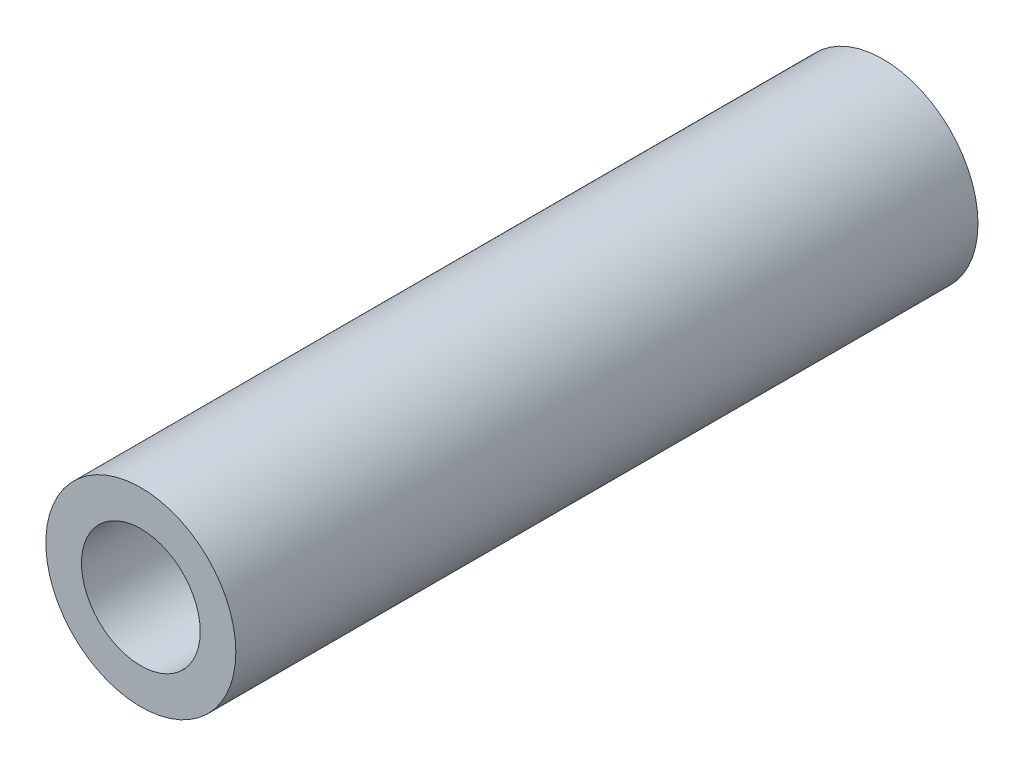
ISO-10303-21;
HEADER;
FILE_DESCRIPTION(('STEP AP214'),'2;1');
FILE_NAME('part.step','',(''),(''),'','','');
FILE_SCHEMA(('AUTOMOTIVE_DESIGN { 1 0 10303 214 1 1 1 1 }'));
ENDSEC;
DATA;
#1=APPLICATION_CONTEXT('core data for automotive mechanical design processes');
#2=APPLICATION_PROTOCOL_DEFINITION('international standard','automotive_design',2000,#1);
#3=PRODUCT_CONTEXT('',#1,'mechanical');
#4=PRODUCT('Part','Part','',(#3));
#5=PRODUCT_RELATED_PRODUCT_CATEGORY('part','',(#4));
#6=PRODUCT_DEFINITION_FORMATION('','',#4);
#7=PRODUCT_DEFINITION_CONTEXT('part definition',#1,'design');
#8=PRODUCT_DEFINITION('design','',#6,#7);
#9=PRODUCT_DEFINITION_SHAPE('','',#8);
#10=(LENGTH_UNIT() NAMED_UNIT(*) SI_UNIT(.MILLI.,.METRE.));
#11=(NAMED_UNIT(*) PLANE_ANGLE_UNIT() SI_UNIT($,.RADIAN.));
#12=(NAMED_UNIT(*) SI_UNIT($,.STERADIAN.) SOLID_ANGLE_UNIT());
#13=UNCERTAINTY_MEASURE_WITH_UNIT(LENGTH_MEASURE(1.E-05),#10,'distance_accuracy_value','');
#14=(GEOMETRIC_REPRESENTATION_CONTEXT(3) GLOBAL_UNCERTAINTY_ASSIGNED_CONTEXT((#13)) GLOBAL_UNIT_ASSIGNED_CONTEXT((#10,
#11,#12)) REPRESENTATION_CONTEXT('',''));
#15=CARTESIAN_POINT('',(0.,0.,0.));
#16=DIRECTION('',(0.,0.,1.));
#17=DIRECTION('',(1.,0.,0.));
#18=AXIS2_PLACEMENT_3D('',#15,#16,#17);
#19=CARTESIAN_POINT('',(0.,0.,25.));
#20=DIRECTION('',(0.,0.,-1.));
#21=DIRECTION('',(-1.,0.,0.));
#22=AXIS2_PLACEMENT_3D('',#19,#20,#21);
#23=CYLINDRICAL_SURFACE('',#22,3.2);
#24=CARTESIAN_POINT('',(0.,0.,25.));
#25=DIRECTION('',(0.,0.,1.));
#26=DIRECTION('',(1.,0.,0.));
#27=AXIS2_PLACEMENT_3D('',#24,#25,#26);
#28=CIRCLE('',#27,3.2);
#29=CARTESIAN_POINT('',(3.2,0.,25.));
#30=VERTEX_POINT('',#29);
#31=EDGE_CURVE('E10',#30,#30,#28,.T.);
#32=ORIENTED_EDGE('',*,*,#31,.F.);
#33=EDGE_LOOP('',(#32));
#34=FACE_BOUND('',#33,.T.);
#35=CARTESIAN_POINT('',(0.,0.,0.));
#36=DIRECTION('',(0.,0.,1.));
#37=DIRECTION('',(1.,0.,0.));
#38=AXIS2_PLACEMENT_3D('',#35,#36,#37);
#39=CIRCLE('',#38,3.2);
#40=CARTESIAN_POINT('',(3.2,0.,0.));
#41=VERTEX_POINT('',#40);
#42=EDGE_CURVE('E34',#41,#41,#39,.T.);
#43=ORIENTED_EDGE('',*,*,#42,.T.);
#44=EDGE_LOOP('',(#43));
#45=FACE_BOUND('',#44,.T.);
#46=ADVANCED_FACE('F31',(#34,#45),#23,.T.);
#47=CARTESIAN_POINT('',(0.,0.,25.));
#48=DIRECTION('',(0.,0.,1.));
#49=DIRECTION('',(1.,0.,0.));
#50=AXIS2_PLACEMENT_3D('',#47,#48,#49);
#51=PLANE('',#50);
#52=CARTESIAN_POINT('',(0.,0.,25.));
#53=DIRECTION('',(0.,0.,1.));
#54=DIRECTION('',(1.,0.,0.));
#55=AXIS2_PLACEMENT_3D('',#52,#53,#54);
#56=CIRCLE('',#55,2.);
#57=CARTESIAN_POINT('',(2.,0.,25.));
#58=VERTEX_POINT('',#57);
#59=EDGE_CURVE('E43',#58,#58,#56,.T.);
#60=ORIENTED_EDGE('',*,*,#59,.F.);
#61=EDGE_LOOP('',(#60));
#62=FACE_BOUND('',#61,.T.);
#63=ORIENTED_EDGE('',*,*,#31,.T.);
#64=EDGE_LOOP('',(#63));
#65=FACE_BOUND('',#64,.T.);
#66=ADVANCED_FACE('F58',(#62,#65),#51,.T.);
#67=CARTESIAN_POINT('',(0.,0.,0.));
#68=DIRECTION('',(0.,0.,1.));
#69=DIRECTION('',(1.,0.,0.));
#70=AXIS2_PLACEMENT_3D('',#67,#68,#69);
#71=PLANE('',#70);
#72=CARTESIAN_POINT('',(0.,0.,0.));
#73=DIRECTION('',(0.,0.,1.));
#74=DIRECTION('',(1.,0.,0.));
#75=AXIS2_PLACEMENT_3D('',#72,#73,#74);
#76=CIRCLE('',#75,2.);
#77=CARTESIAN_POINT('',(2.,0.,0.));
#78=VERTEX_POINT('',#77);
#79=EDGE_CURVE('E41',#78,#78,#76,.T.);
#80=ORIENTED_EDGE('',*,*,#79,.T.);
#81=EDGE_LOOP('',(#80));
#82=FACE_BOUND('',#81,.T.);
#83=ORIENTED_EDGE('',*,*,#42,.F.);
#84=EDGE_LOOP('',(#83));
#85=FACE_BOUND('',#84,.T.);
#86=ADVANCED_FACE('F49',(#82,#85),#71,.F.);
#87=CARTESIAN_POINT('',(0.,0.,0.));
#88=DIRECTION('',(0.,0.,1.));
#89=DIRECTION('',(1.,0.,0.));
#90=AXIS2_PLACEMENT_3D('',#87,#88,#89);
#91=CYLINDRICAL_SURFACE('',#90,2.);
#92=ORIENTED_EDGE('',*,*,#79,.F.);
#93=EDGE_LOOP('',(#92));
#94=FACE_BOUND('',#93,.T.);
#95=ORIENTED_EDGE('',*,*,#59,.T.);
#96=EDGE_LOOP('',(#95));
#97=FACE_BOUND('',#96,.T.);
#98=ADVANCED_FACE('F52',(#94,#97),#91,.F.);
#99=CLOSED_SHELL('',(#46,#66,#86,#98));
#100=MANIFOLD_SOLID_BREP('B2',#99);
#101=ADVANCED_BREP_SHAPE_REPRESENTATION('',(#18,#100),#14);
#102=SHAPE_DEFINITION_REPRESENTATION(#9,#101);
ENDSEC;
END-ISO-10303-21;
